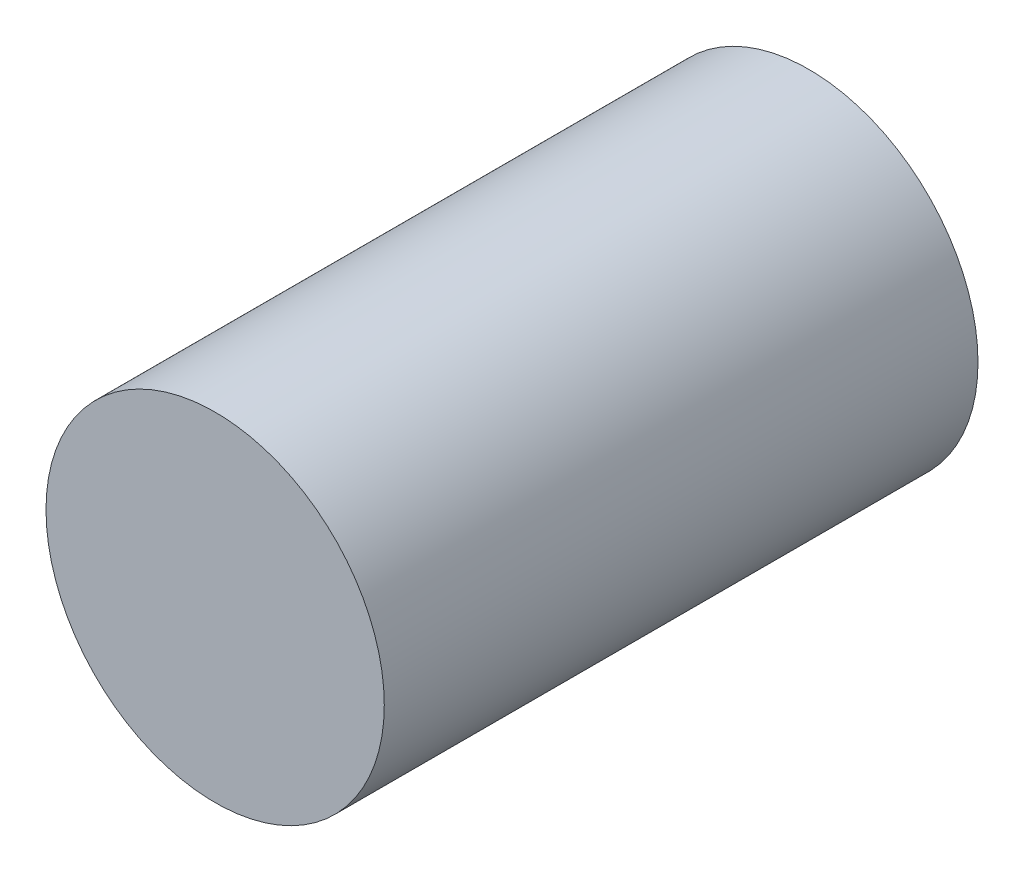
ISO-10303-21;
HEADER;
FILE_DESCRIPTION(('STEP AP214'),'2;1');
FILE_NAME('part.step','',(''),(''),'','','');
FILE_SCHEMA(('AUTOMOTIVE_DESIGN { 1 0 10303 214 1 1 1 1 }'));
ENDSEC;
DATA;
#1=APPLICATION_CONTEXT('core data for automotive mechanical design processes');
#2=APPLICATION_PROTOCOL_DEFINITION('international standard','automotive_design',2000,#1);
#3=PRODUCT_CONTEXT('',#1,'mechanical');
#4=PRODUCT('Part','Part','',(#3));
#5=PRODUCT_RELATED_PRODUCT_CATEGORY('part','',(#4));
#6=PRODUCT_DEFINITION_FORMATION('','',#4);
#7=PRODUCT_DEFINITION_CONTEXT('part definition',#1,'design');
#8=PRODUCT_DEFINITION('design','',#6,#7);
#9=PRODUCT_DEFINITION_SHAPE('','',#8);
#10=(LENGTH_UNIT() NAMED_UNIT(*) SI_UNIT(.MILLI.,.METRE.));
#11=(NAMED_UNIT(*) PLANE_ANGLE_UNIT() SI_UNIT($,.RADIAN.));
#12=(NAMED_UNIT(*) SI_UNIT($,.STERADIAN.) SOLID_ANGLE_UNIT());
#13=UNCERTAINTY_MEASURE_WITH_UNIT(LENGTH_MEASURE(1.E-05),#10,'distance_accuracy_value','');
#14=(GEOMETRIC_REPRESENTATION_CONTEXT(3) GLOBAL_UNCERTAINTY_ASSIGNED_CONTEXT((#13)) GLOBAL_UNIT_ASSIGNED_CONTEXT((#10,
#11,#12)) REPRESENTATION_CONTEXT('',''));
#15=CARTESIAN_POINT('',(0.,0.,0.));
#16=DIRECTION('',(0.,0.,1.));
#17=DIRECTION('',(1.,0.,0.));
#18=AXIS2_PLACEMENT_3D('',#15,#16,#17);
#19=CARTESIAN_POINT('',(0.0999998,0.,0.));
#20=DIRECTION('',(0.,0.,-1.));
#21=DIRECTION('',(-1.,0.,0.));
#22=AXIS2_PLACEMENT_3D('',#19,#20,#21);
#23=PLANE('',#22);
#24=CARTESIAN_POINT('',(0.,0.,0.));
#25=DIRECTION('',(0.,0.,-1.));
#26=DIRECTION('',(-1.,0.,0.));
#27=AXIS2_PLACEMENT_3D('',#24,#25,#26);
#28=CIRCLE('',#27,0.0999998);
#29=CARTESIAN_POINT('',(-0.0999998,0.,0.));
#30=VERTEX_POINT('',#29);
#31=EDGE_CURVE('E17',#30,#30,#28,.F.);
#32=ORIENTED_EDGE('',*,*,#31,.F.);
#33=EDGE_LOOP('',(#32));
#34=FACE_BOUND('',#33,.T.);
#35=ADVANCED_FACE('F14',(#34),#23,.T.);
#36=CARTESIAN_POINT('',(0.0999998,0.,0.35100006));
#37=DIRECTION('',(0.,0.,-1.));
#38=DIRECTION('',(-1.,0.,0.));
#39=AXIS2_PLACEMENT_3D('',#36,#37,#38);
#40=PLANE('',#39);
#41=CARTESIAN_POINT('',(0.,0.,0.35100006));
#42=DIRECTION('',(0.,0.,-1.));
#43=DIRECTION('',(-1.,0.,0.));
#44=AXIS2_PLACEMENT_3D('',#41,#42,#43);
#45=CIRCLE('',#44,0.0999998);
#46=CARTESIAN_POINT('',(-0.0999998,0.,0.35100006));
#47=VERTEX_POINT('',#46);
#48=EDGE_CURVE('E9',#47,#47,#45,.T.);
#49=ORIENTED_EDGE('',*,*,#48,.F.);
#50=EDGE_LOOP('',(#49));
#51=FACE_BOUND('',#50,.T.);
#52=ADVANCED_FACE('F29',(#51),#40,.F.);
#53=CARTESIAN_POINT('',(0.,0.,0.));
#54=DIRECTION('',(0.,0.,-1.));
#55=DIRECTION('',(-1.,0.,0.));
#56=AXIS2_PLACEMENT_3D('',#53,#54,#55);
#57=CYLINDRICAL_SURFACE('',#56,0.0999998);
#58=ORIENTED_EDGE('',*,*,#31,.T.);
#59=EDGE_LOOP('',(#58));
#60=FACE_BOUND('',#59,.T.);
#61=ORIENTED_EDGE('',*,*,#48,.T.);
#62=EDGE_LOOP('',(#61));
#63=FACE_BOUND('',#62,.T.);
#64=ADVANCED_FACE('F26',(#60,#63),#57,.T.);
#65=CLOSED_SHELL('',(#35,#52,#64));
#66=MANIFOLD_SOLID_BREP('B1',#65);
#67=ADVANCED_BREP_SHAPE_REPRESENTATION('',(#18,#66),#14);
#68=SHAPE_DEFINITION_REPRESENTATION(#9,#67);
ENDSEC;
END-ISO-10303-21;
